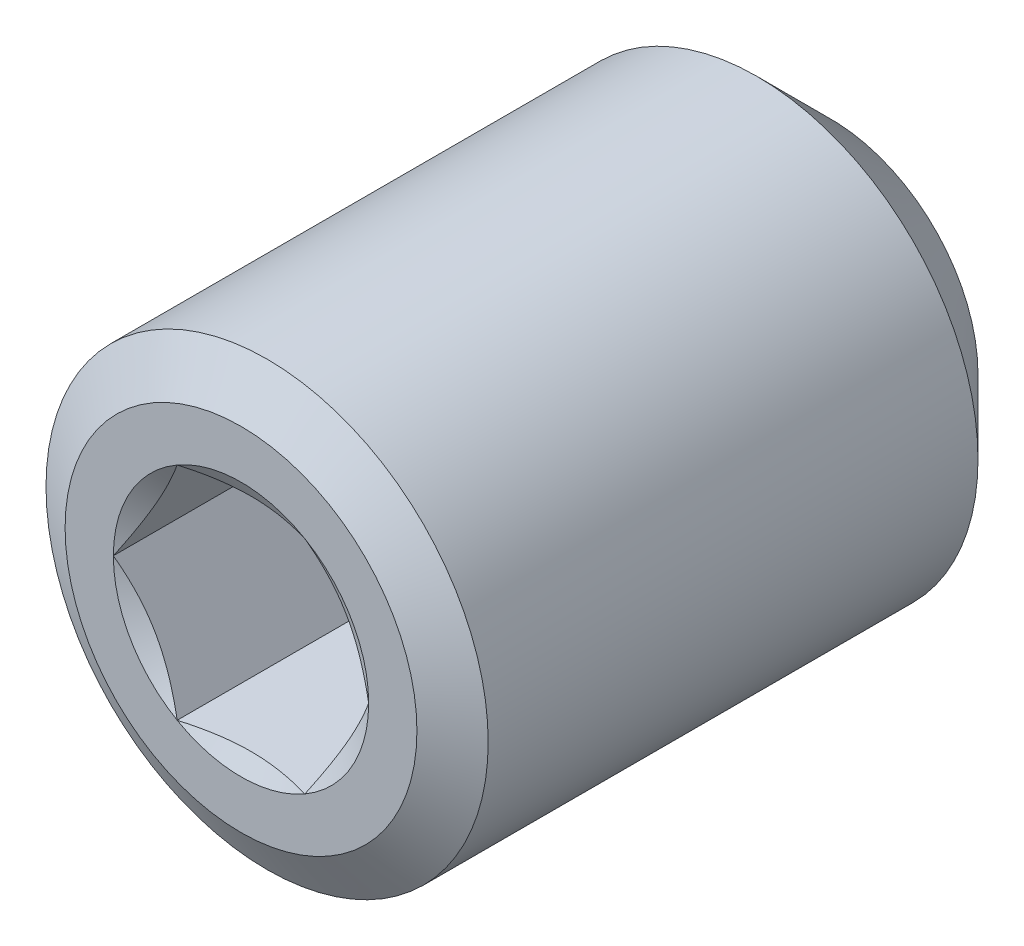
ISO-10303-21;
HEADER;
FILE_DESCRIPTION(('STEP AP214'),'2;1');
FILE_NAME('part.step','',(''),(''),'','','');
FILE_SCHEMA(('AUTOMOTIVE_DESIGN { 1 0 10303 214 1 1 1 1 }'));
ENDSEC;
DATA;
#1=APPLICATION_CONTEXT('core data for automotive mechanical design processes');
#2=APPLICATION_PROTOCOL_DEFINITION('international standard','automotive_design',2000,#1);
#3=PRODUCT_CONTEXT('',#1,'mechanical');
#4=PRODUCT('Part','Part','',(#3));
#5=PRODUCT_RELATED_PRODUCT_CATEGORY('part','',(#4));
#6=PRODUCT_DEFINITION_FORMATION('','',#4);
#7=PRODUCT_DEFINITION_CONTEXT('part definition',#1,'design');
#8=PRODUCT_DEFINITION('design','',#6,#7);
#9=PRODUCT_DEFINITION_SHAPE('','',#8);
#10=(LENGTH_UNIT() NAMED_UNIT(*) SI_UNIT(.MILLI.,.METRE.));
#11=(NAMED_UNIT(*) PLANE_ANGLE_UNIT() SI_UNIT($,.RADIAN.));
#12=(NAMED_UNIT(*) SI_UNIT($,.STERADIAN.) SOLID_ANGLE_UNIT());
#13=UNCERTAINTY_MEASURE_WITH_UNIT(LENGTH_MEASURE(1.E-05),#10,'distance_accuracy_value','');
#14=(GEOMETRIC_REPRESENTATION_CONTEXT(3) GLOBAL_UNCERTAINTY_ASSIGNED_CONTEXT((#13)) GLOBAL_UNIT_ASSIGNED_CONTEXT((#10,
#11,#12)) REPRESENTATION_CONTEXT('',''));
#15=CARTESIAN_POINT('',(0.,0.,0.));
#16=DIRECTION('',(0.,0.,1.));
#17=DIRECTION('',(1.,0.,0.));
#18=AXIS2_PLACEMENT_3D('',#15,#16,#17);
#19=CARTESIAN_POINT('',(-5.4,0.,6.05));
#20=DIRECTION('',(0.,0.,-1.));
#21=DIRECTION('',(-1.,0.,0.));
#22=AXIS2_PLACEMENT_3D('',#19,#20,#21);
#23=PLANE('',#22);
#24=DIRECTION('',(1.,0.,0.));
#25=VECTOR('',#24,1.);
#26=CARTESIAN_POINT('',(-5.83301270189222,-0.749999999999999,6.05));
#27=LINE('',#26,#25);
#28=CARTESIAN_POINT('',(-5.83301270189222,-0.749999999999999,6.05));
#29=VERTEX_POINT('',#28);
#30=CARTESIAN_POINT('',(-4.96698729810778,-0.749999999999999,6.05));
#31=VERTEX_POINT('',#30);
#32=EDGE_CURVE('E116',#29,#31,#27,.T.);
#33=ORIENTED_EDGE('',*,*,#32,.T.);
#34=DIRECTION('',(0.5,0.866025403784439,0.));
#35=VECTOR('',#34,1.);
#36=CARTESIAN_POINT('',(-4.96698729810778,-0.749999999999999,6.05));
#37=LINE('',#36,#35);
#38=CARTESIAN_POINT('',(-4.53397459621556,0.,6.05));
#39=VERTEX_POINT('',#38);
#40=EDGE_CURVE('E82',#31,#39,#37,.T.);
#41=ORIENTED_EDGE('',*,*,#40,.T.);
#42=DIRECTION('',(-0.5,0.866025403784439,0.));
#43=VECTOR('',#42,1.);
#44=CARTESIAN_POINT('',(-4.53397459621556,0.,6.05));
#45=LINE('',#44,#43);
#46=CARTESIAN_POINT('',(-4.96698729810778,0.750000000000001,6.05));
#47=VERTEX_POINT('',#46);
#48=EDGE_CURVE('E84',#39,#47,#45,.T.);
#49=ORIENTED_EDGE('',*,*,#48,.T.);
#50=DIRECTION('',(1.,0.,0.));
#51=VECTOR('',#50,1.);
#52=CARTESIAN_POINT('',(-4.96698729810778,0.750000000000001,6.05));
#53=LINE('',#52,#51);
#54=CARTESIAN_POINT('',(-5.83301270189222,0.750000000000001,6.05));
#55=VERTEX_POINT('',#54);
#56=EDGE_CURVE('E85',#47,#55,#53,.F.);
#57=ORIENTED_EDGE('',*,*,#56,.T.);
#58=DIRECTION('',(-0.5,-0.866025403784439,0.));
#59=VECTOR('',#58,1.);
#60=CARTESIAN_POINT('',(-5.83301270189222,0.750000000000001,6.05));
#61=LINE('',#60,#59);
#62=CARTESIAN_POINT('',(-6.26602540378444,0.,6.05));
#63=VERTEX_POINT('',#62);
#64=EDGE_CURVE('E71',#55,#63,#61,.T.);
#65=ORIENTED_EDGE('',*,*,#64,.T.);
#66=DIRECTION('',(0.5,-0.866025403784439,0.));
#67=VECTOR('',#66,1.);
#68=CARTESIAN_POINT('',(-6.26602540378444,0.,6.05));
#69=LINE('',#68,#67);
#70=EDGE_CURVE('E105',#63,#29,#69,.T.);
#71=ORIENTED_EDGE('',*,*,#70,.T.);
#72=EDGE_LOOP('',(#33,#41,#49,#57,#65,#71));
#73=FACE_BOUND('',#72,.T.);
#74=ADVANCED_FACE('F17',(#73),#23,.F.);
#75=CARTESIAN_POINT('',(-4.96698729810778,0.750000000000001,7.25));
#76=DIRECTION('',(0.,1.,0.));
#77=DIRECTION('',(0.,0.,1.));
#78=AXIS2_PLACEMENT_3D('',#75,#76,#77);
#79=PLANE('',#78);
#80=DIRECTION('',(0.,0.,1.));
#81=VECTOR('',#80,1.);
#82=CARTESIAN_POINT('',(-5.83301270189222,0.750000000000001,7.25));
#83=LINE('',#82,#81);
#84=CARTESIAN_POINT('',(-5.83301270188439,0.750000000021349,7.24999999999327));
#85=VERTEX_POINT('',#84);
#86=EDGE_CURVE('E91',#85,#55,#83,.F.);
#87=ORIENTED_EDGE('',*,*,#86,.T.);
#88=ORIENTED_EDGE('',*,*,#56,.F.);
#89=DIRECTION('',(0.,0.,1.));
#90=VECTOR('',#89,1.);
#91=CARTESIAN_POINT('',(-4.96698729810778,0.750000000000002,7.25));
#92=LINE('',#91,#90);
#93=CARTESIAN_POINT('',(-4.96698729810162,0.750000000010675,7.24999999999197));
#94=VERTEX_POINT('',#93);
#95=EDGE_CURVE('E58',#47,#94,#92,.T.);
#96=ORIENTED_EDGE('',*,*,#95,.T.);
#97=CARTESIAN_POINT('',(-4.9669872980988,0.750000000000001,7.24999999998745));
#98=CARTESIAN_POINT('',(-5.00253334717891,0.750000000000001,7.2397376648182));
#99=CARTESIAN_POINT('',(-5.03836059706336,0.750000000000001,7.23034220746279));
#100=CARTESIAN_POINT('',(-5.11059708569754,0.750000000000001,7.21373690236903));
#101=CARTESIAN_POINT('',(-5.14700743833595,0.750000000000001,7.20653194479867));
#102=CARTESIAN_POINT('',(-5.21941958688233,0.750000000000001,7.19494550076308));
#103=CARTESIAN_POINT('',(-5.2554111877375,0.750000000000001,7.19050224022856));
#104=CARTESIAN_POINT('',(-5.32760203793876,0.750000000000001,7.18453742650338));
#105=CARTESIAN_POINT('',(-5.36380101896938,0.750000000000001,7.18301270190296));
#106=CARTESIAN_POINT('',(-5.43619898103062,0.750000000000001,7.18301270190296));
#107=CARTESIAN_POINT('',(-5.47239796206124,0.750000000000001,7.18453742650338));
#108=CARTESIAN_POINT('',(-5.5445888122625,0.750000000000001,7.19050224022856));
#109=CARTESIAN_POINT('',(-5.58058041311767,0.750000000000001,7.19494550076308));
#110=CARTESIAN_POINT('',(-5.65299256166405,0.750000000000001,7.20653194479867));
#111=CARTESIAN_POINT('',(-5.68940291430246,0.750000000000001,7.21373690236903));
#112=CARTESIAN_POINT('',(-5.76163940293664,0.750000000000001,7.23034220746279));
#113=CARTESIAN_POINT('',(-5.79746665282109,0.750000000000001,7.2397376648182));
#114=CARTESIAN_POINT('',(-5.8330127019012,0.750000000000001,7.24999999998745));
#115=B_SPLINE_CURVE_WITH_KNOTS('',3,(#97,#98,#99,#100,#101,#102,#103,#104,#105,#106,#107,#108,
#109,#110,#111,#112,#113,#114),.UNSPECIFIED.,.F.,.F.,(4,2,2,2,2,2,2,2,4),(0.,0.111027523469266,
0.222301119783371,0.330986572190886,0.439553855000989,0.548121137811094,0.656806590218607,
0.768080186532712,0.879107710001979),.UNSPECIFIED.);
#116=EDGE_CURVE('E20',#94,#85,#115,.T.);
#117=ORIENTED_EDGE('',*,*,#116,.T.);
#118=EDGE_LOOP('',(#87,#88,#96,#117));
#119=FACE_BOUND('',#118,.T.);
#120=ADVANCED_FACE('F89',(#119),#79,.F.);
#121=CARTESIAN_POINT('',(-4.53397459621556,0.,7.25));
#122=DIRECTION('',(0.866025403784439,0.5,0.));
#123=DIRECTION('',(-0.5,0.866025403784439,0.));
#124=AXIS2_PLACEMENT_3D('',#121,#122,#123);
#125=PLANE('',#124);
#126=ORIENTED_EDGE('',*,*,#95,.F.);
#127=ORIENTED_EDGE('',*,*,#48,.F.);
#128=DIRECTION('',(0.,0.,1.));
#129=VECTOR('',#128,1.);
#130=CARTESIAN_POINT('',(-4.53397459621556,0.,7.25));
#131=LINE('',#130,#129);
#132=CARTESIAN_POINT('',(-4.53397459620324,0.,7.24999999999197));
#133=VERTEX_POINT('',#132);
#134=EDGE_CURVE('E97',#39,#133,#131,.T.);
#135=ORIENTED_EDGE('',*,*,#134,.T.);
#136=CARTESIAN_POINT('',(-4.53397459621107,-7.77831101686523E-12,7.24999999998745));
#137=CARTESIAN_POINT('',(-4.55300288191491,0.0329579576122051,7.23901082827139));
#138=CARTESIAN_POINT('',(-4.57219541962215,0.0662004080473306,7.22901675266053));
#139=CARTESIAN_POINT('',(-4.6109128010648,0.133260879842025,7.21157239449462));
#140=CARTESIAN_POINT('',(-4.6304383325094,0.167080092348856,7.20412828242054));
#141=CARTESIAN_POINT('',(-4.66924742519736,0.234299412680047,7.19254098480828));
#142=CARTESIAN_POINT('',(-4.68852501683877,0.267689180850541,7.18832067040491));
#143=CARTESIAN_POINT('',(-4.72717086025429,0.334625745147565,7.18328343799773));
#144=CARTESIAN_POINT('',(-4.74653897165761,0.368172298144786,7.18246234772907));
#145=CARTESIAN_POINT('',(-4.78272621005057,0.430850433626997,7.18417485882044));
#146=CARTESIAN_POINT('',(-4.79955076723076,0.45999142147793,7.18628798195908));
#147=CARTESIAN_POINT('',(-4.83309027509029,0.518083553151492,7.19298398776408));
#148=CARTESIAN_POINT('',(-4.84980510985202,0.547034496198919,7.19756915553422));
#149=CARTESIAN_POINT('',(-4.88341371226155,0.605246303143616,7.20903118749734));
#150=CARTESIAN_POINT('',(-4.90030322843297,0.63449980326777,7.21595661582554));
#151=CARTESIAN_POINT('',(-4.93383042649982,0.692570613754971,7.23167441030472));
#152=CARTESIAN_POINT('',(-4.95046853758607,0.721388667498332,7.24046308577011));
#153=CARTESIAN_POINT('',(-4.96698729811227,0.750000000007781,7.24999999998745));
#154=B_SPLINE_CURVE_WITH_KNOTS('',3,(#136,#137,#138,#139,#140,#141,#142,#143,#144,#145,#146,
#147,#148,#149,#150,#151,#152,#153),.UNSPECIFIED.,.F.,.F.,(4,2,2,2,2,2,2,2,4),(0.,
0.118881004361371,0.238047681444985,0.354265352364141,0.470340333390544,0.571390418547985,
0.672534072741057,0.775920608507762,0.879104240149057),.UNSPECIFIED.);
#155=EDGE_CURVE('E95',#133,#94,#154,.T.);
#156=ORIENTED_EDGE('',*,*,#155,.T.);
#157=EDGE_LOOP('',(#126,#127,#135,#156));
#158=FACE_BOUND('',#157,.T.);
#159=ADVANCED_FACE('F93',(#158),#125,.F.);
#160=CARTESIAN_POINT('',(-4.96698729810778,-0.749999999999999,7.25));
#161=DIRECTION('',(0.866025403784439,-0.5,0.));
#162=DIRECTION('',(0.5,0.866025403784439,0.));
#163=AXIS2_PLACEMENT_3D('',#160,#161,#162);
#164=PLANE('',#163);
#165=ORIENTED_EDGE('',*,*,#134,.F.);
#166=ORIENTED_EDGE('',*,*,#40,.F.);
#167=DIRECTION('',(0.,0.,-1.));
#168=VECTOR('',#167,1.);
#169=CARTESIAN_POINT('',(-4.96698729810778,-0.749999999999999,7.25));
#170=LINE('',#169,#168);
#171=CARTESIAN_POINT('',(-4.96698729810162,-0.750000000010673,7.25000000000399));
#172=VERTEX_POINT('',#171);
#173=EDGE_CURVE('E108',#31,#172,#170,.F.);
#174=ORIENTED_EDGE('',*,*,#173,.T.);
#175=CARTESIAN_POINT('',(-4.96698729811396,-0.750000000007281,7.24999999998869));
#176=CARTESIAN_POINT('',(-4.94795901240921,-0.717042042387902,7.23901082827192));
#177=CARTESIAN_POINT('',(-4.92876647470155,-0.683799591952968,7.22901675266074));
#178=CARTESIAN_POINT('',(-4.89004909325854,-0.6167391201583,7.21157239449456));
#179=CARTESIAN_POINT('',(-4.87052356181398,-0.582919907651302,7.20412828242054));
#180=CARTESIAN_POINT('',(-4.831714469126,-0.515700587319894,7.1925409848083));
#181=CARTESIAN_POINT('',(-4.81243687748452,-0.482310819149347,7.18832067040491));
#182=CARTESIAN_POINT('',(-4.7737910340689,-0.415374254852186,7.18328343799771));
#183=CARTESIAN_POINT('',(-4.75442292266553,-0.381827701854883,7.18246234772906));
#184=CARTESIAN_POINT('',(-4.71823568427255,-0.319149566372629,7.18417485882047));
#185=CARTESIAN_POINT('',(-4.70141112709239,-0.290008578521735,7.18628798195912));
#186=CARTESIAN_POINT('',(-4.6678716192329,-0.231916446848252,7.19298398776411));
#187=CARTESIAN_POINT('',(-4.6511567844712,-0.202965503800864,7.19756915553425));
#188=CARTESIAN_POINT('',(-4.6175481820617,-0.144753696856239,7.20903118749737));
#189=CARTESIAN_POINT('',(-4.6006586658903,-0.115500196732117,7.21595661582557));
#190=CARTESIAN_POINT('',(-4.56713146782349,-0.0574293862449746,7.23167441030474));
#191=CARTESIAN_POINT('',(-4.55049335673726,-0.0286113325016418,7.24046308577012));
#192=CARTESIAN_POINT('',(-4.53397459621107,7.7807565036674E-12,7.24999999998745));
#193=B_SPLINE_CURVE_WITH_KNOTS('',3,(#175,#176,#177,#178,#179,#180,#181,#182,#183,#184,#185,
#186,#187,#188,#189,#190,#191,#192),.UNSPECIFIED.,.F.,.F.,(4,2,2,2,2,2,2,2,4),(0.,
0.118881004361718,0.238047681445647,0.354265352365057,0.470340333391727,0.571390418549038,
0.672534072741974,0.77592060850857,0.879104240149767),.UNSPECIFIED.);
#194=EDGE_CURVE('E190',#172,#133,#193,.T.);
#195=ORIENTED_EDGE('',*,*,#194,.T.);
#196=EDGE_LOOP('',(#165,#166,#174,#195));
#197=FACE_BOUND('',#196,.T.);
#198=ADVANCED_FACE('F199',(#197),#164,.F.);
#199=CARTESIAN_POINT('',(-5.83301270189222,-0.749999999999999,7.25));
#200=DIRECTION('',(0.,-1.,0.));
#201=DIRECTION('',(0.,0.,-1.));
#202=AXIS2_PLACEMENT_3D('',#199,#200,#201);
#203=PLANE('',#202);
#204=ORIENTED_EDGE('',*,*,#173,.F.);
#205=ORIENTED_EDGE('',*,*,#32,.F.);
#206=DIRECTION('',(0.,0.,1.));
#207=VECTOR('',#206,1.);
#208=CARTESIAN_POINT('',(-5.83301270189222,-0.75,7.25));
#209=LINE('',#208,#207);
#210=CARTESIAN_POINT('',(-5.83301270189222,-0.75,7.2500000000204));
#211=VERTEX_POINT('',#210);
#212=EDGE_CURVE('E107',#29,#211,#209,.T.);
#213=ORIENTED_EDGE('',*,*,#212,.T.);
#214=CARTESIAN_POINT('',(-5.8330127018994,-0.749999999999999,7.25000000001096));
#215=CARTESIAN_POINT('',(-5.79746665281979,-0.749999999999999,7.23973766483822));
#216=CARTESIAN_POINT('',(-5.76163940293568,-0.749999999999999,7.23034220747957));
#217=CARTESIAN_POINT('',(-5.68940291430177,-0.749999999999999,7.21373690237998));
#218=CARTESIAN_POINT('',(-5.65299256166328,-0.749999999999999,7.20653194480705));
#219=CARTESIAN_POINT('',(-5.58058041311704,-0.749999999999999,7.1949455007674));
#220=CARTESIAN_POINT('',(-5.54458881226208,-0.749999999999999,7.19050224023133));
#221=CARTESIAN_POINT('',(-5.4723979620611,-0.749999999999999,7.18453742650406));
#222=CARTESIAN_POINT('',(-5.43619898103055,-0.749999999999999,7.18301270190311));
#223=CARTESIAN_POINT('',(-5.36380101896978,-0.749999999999999,7.18301270190311));
#224=CARTESIAN_POINT('',(-5.32760203793956,-0.749999999999999,7.18453742650403));
#225=CARTESIAN_POINT('',(-5.25541118773924,-0.749999999999999,7.19050224023119));
#226=CARTESIAN_POINT('',(-5.2194195868846,-0.749999999999999,7.19494550076719));
#227=CARTESIAN_POINT('',(-5.147007438339,-0.749999999999999,7.20653194480663));
#228=CARTESIAN_POINT('',(-5.11059708570085,-0.749999999999999,7.21373690237944));
#229=CARTESIAN_POINT('',(-5.03836059706758,-0.749999999999999,7.23034220747875));
#230=CARTESIAN_POINT('',(-5.00253334718378,-0.749999999999999,7.23973766483726));
#231=CARTESIAN_POINT('',(-4.96698729810449,-0.749999999999999,7.25000000000983));
#232=B_SPLINE_CURVE_WITH_KNOTS('',3,(#214,#215,#216,#217,#218,#219,#220,#221,#222,#223,#224,
#225,#226,#227,#228,#229,#230,#231),.UNSPECIFIED.,.F.,.F.,(4,2,2,2,2,2,2,2,4),(0.,
0.111027523470713,0.222301119786472,0.330986572193851,0.439553855003719,0.548121137812601,
0.65680659021899,0.76808018653371,0.879107710003394),.UNSPECIFIED.);
#233=EDGE_CURVE('E184',#211,#172,#232,.T.);
#234=ORIENTED_EDGE('',*,*,#233,.T.);
#235=EDGE_LOOP('',(#204,#205,#213,#234));
#236=FACE_BOUND('',#235,.T.);
#237=ADVANCED_FACE('F195',(#236),#203,.F.);
#238=CARTESIAN_POINT('',(-6.26602540378444,0.,7.25));
#239=DIRECTION('',(-0.866025403784439,-0.5,0.));
#240=DIRECTION('',(0.5,-0.866025403784439,0.));
#241=AXIS2_PLACEMENT_3D('',#238,#239,#240);
#242=PLANE('',#241);
#243=ORIENTED_EDGE('',*,*,#212,.F.);
#244=ORIENTED_EDGE('',*,*,#70,.F.);
#245=DIRECTION('',(0.,0.,1.));
#246=VECTOR('',#245,1.);
#247=CARTESIAN_POINT('',(-6.26602540378444,0.,7.25));
#248=LINE('',#247,#246);
#249=CARTESIAN_POINT('',(-6.26602540379676,0.,7.24999999999197));
#250=VERTEX_POINT('',#249);
#251=EDGE_CURVE('E39',#63,#250,#248,.T.);
#252=ORIENTED_EDGE('',*,*,#251,.T.);
#253=CARTESIAN_POINT('',(-6.26602540378893,7.78089463416162E-12,7.24999999998745));
#254=CARTESIAN_POINT('',(-6.24699711808509,-0.0329579576122041,7.23901082827139));
#255=CARTESIAN_POINT('',(-6.22780458037785,-0.0662004080473309,7.22901675266053));
#256=CARTESIAN_POINT('',(-6.1890871989352,-0.133260879842028,7.21157239449461));
#257=CARTESIAN_POINT('',(-6.1695616674906,-0.167080092348861,7.20412828242054));
#258=CARTESIAN_POINT('',(-6.13075257480264,-0.234299412680052,7.19254098480828));
#259=CARTESIAN_POINT('',(-6.11147498316123,-0.267689180850544,7.18832067040491));
#260=CARTESIAN_POINT('',(-6.07282913974571,-0.334625745147566,7.18328343799773));
#261=CARTESIAN_POINT('',(-6.05346102834238,-0.368172298144784,7.18246234772907));
#262=CARTESIAN_POINT('',(-6.01727378994923,-0.430850433627343,7.18417485882045));
#263=CARTESIAN_POINT('',(-6.00044923276884,-0.459991421478624,7.18628798195913));
#264=CARTESIAN_POINT('',(-5.96690972490891,-0.518083553152876,7.19298398776427));
#265=CARTESIAN_POINT('',(-5.95019489014699,-0.547034496200644,7.1975691555345));
#266=CARTESIAN_POINT('',(-5.91658628773705,-0.605246303146033,7.20903118749787));
#267=CARTESIAN_POINT('',(-5.89969677156543,-0.634499803270536,7.21595661582622));
#268=CARTESIAN_POINT('',(-5.86616957349819,-0.692570613758423,7.23167441030572));
#269=CARTESIAN_POINT('',(-5.84953146241175,-0.721388667502121,7.2404630857713));
#270=CARTESIAN_POINT('',(-5.83301270188535,-0.750000000011902,7.24999999998883));
#271=B_SPLINE_CURVE_WITH_KNOTS('',3,(#253,#254,#255,#256,#257,#258,#259,#260,#261,#262,#263,
#264,#265,#266,#267,#268,#269,#270),.UNSPECIFIED.,.F.,.F.,(4,2,2,2,2,2,2,2,4),(0.,
0.118881004361376,0.238047681444995,0.354265352364147,0.470340333390545,0.571390418549192,
0.672534072743475,0.775920608511453,0.879104240154011),.UNSPECIFIED.);
#272=EDGE_CURVE('E155',#250,#211,#271,.T.);
#273=ORIENTED_EDGE('',*,*,#272,.T.);
#274=EDGE_LOOP('',(#243,#244,#252,#273));
#275=FACE_BOUND('',#274,.T.);
#276=ADVANCED_FACE('F198',(#275),#242,.F.);
#277=CARTESIAN_POINT('',(-5.83301270189222,0.750000000000001,7.25));
#278=DIRECTION('',(-0.866025403784439,0.5,0.));
#279=DIRECTION('',(-0.5,-0.866025403784439,0.));
#280=AXIS2_PLACEMENT_3D('',#277,#278,#279);
#281=PLANE('',#280);
#282=ORIENTED_EDGE('',*,*,#251,.F.);
#283=ORIENTED_EDGE('',*,*,#64,.F.);
#284=ORIENTED_EDGE('',*,*,#86,.F.);
#285=CARTESIAN_POINT('',(-5.83301270188773,0.75000000000778,7.24999999998745));
#286=CARTESIAN_POINT('',(-5.85204098759157,0.717042042387797,7.23901082827139));
#287=CARTESIAN_POINT('',(-5.87123352529881,0.683799591952671,7.22901675266053));
#288=CARTESIAN_POINT('',(-5.90995090674146,0.616739120157977,7.21157239449461));
#289=CARTESIAN_POINT('',(-5.92947643818606,0.582919907651145,7.20412828242054));
#290=CARTESIAN_POINT('',(-5.96828553087402,0.515700587319955,7.19254098480828));
#291=CARTESIAN_POINT('',(-5.98756312251543,0.482310819149462,7.18832067040491));
#292=CARTESIAN_POINT('',(-6.02620896593095,0.415374254852437,7.18328343799773));
#293=CARTESIAN_POINT('',(-6.04557707733427,0.381827701855217,7.18246234772907));
#294=CARTESIAN_POINT('',(-6.08176431572723,0.319149566373006,7.18417485882044));
#295=CARTESIAN_POINT('',(-6.09858887290742,0.290008578522072,7.18628798195908));
#296=CARTESIAN_POINT('',(-6.13212838076695,0.23191644684851,7.19298398776408));
#297=CARTESIAN_POINT('',(-6.14884321552868,0.202965503801083,7.19756915553422));
#298=CARTESIAN_POINT('',(-6.18245181793821,0.144753696856386,7.20903118749734));
#299=CARTESIAN_POINT('',(-6.19934133410963,0.115500196732233,7.21595661582554));
#300=CARTESIAN_POINT('',(-6.23286853217648,0.0574293862450315,7.23167441030472));
#301=CARTESIAN_POINT('',(-6.24950664326273,0.0286113325016707,7.24046308577011));
#302=CARTESIAN_POINT('',(-6.26602540378893,-7.77911706122302E-12,7.24999999998745));
#303=B_SPLINE_CURVE_WITH_KNOTS('',3,(#285,#286,#287,#288,#289,#290,#291,#292,#293,#294,#295,
#296,#297,#298,#299,#300,#301,#302),.UNSPECIFIED.,.F.,.F.,(4,2,2,2,2,2,2,2,4),(0.,
0.118881004361371,0.238047681444985,0.35426535236414,0.470340333390543,0.571390418547985,
0.672534072741056,0.775920608507761,0.879104240149057),.UNSPECIFIED.);
#304=EDGE_CURVE('E148',#85,#250,#303,.T.);
#305=ORIENTED_EDGE('',*,*,#304,.T.);
#306=EDGE_LOOP('',(#282,#283,#284,#305));
#307=FACE_BOUND('',#306,.T.);
#308=ADVANCED_FACE('F162',(#307),#281,.F.);
#309=CARTESIAN_POINT('',(-5.4,0.,7.24999999999909));
#310=DIRECTION('',(0.,0.,1.));
#311=DIRECTION('',(1.,0.,0.));
#312=AXIS2_PLACEMENT_3D('',#309,#310,#311);
#313=CONICAL_SURFACE('',#312,0.866025403809089,1.04719755136393);
#314=ORIENTED_EDGE('',*,*,#116,.F.);
#315=CARTESIAN_POINT('',(-5.4,0.,7.24999999999909));
#316=DIRECTION('',(0.,0.,1.));
#317=DIRECTION('',(1.,0.,0.));
#318=AXIS2_PLACEMENT_3D('',#315,#316,#317);
#319=CIRCLE('',#318,0.86602540380909);
#320=EDGE_CURVE('E145',#85,#94,#319,.F.);
#321=ORIENTED_EDGE('',*,*,#320,.F.);
#322=EDGE_LOOP('',(#314,#321));
#323=FACE_BOUND('',#322,.T.);
#324=ADVANCED_FACE('F215',(#323),#313,.F.);
#325=CARTESIAN_POINT('',(-5.4,0.,7.24999999999909));
#326=DIRECTION('',(0.,0.,1.));
#327=DIRECTION('',(1.,0.,0.));
#328=AXIS2_PLACEMENT_3D('',#325,#326,#327);
#329=CONICAL_SURFACE('',#328,0.866025403809089,1.04719755130704);
#330=CARTESIAN_POINT('',(-5.4,0.,7.24999999999909));
#331=DIRECTION('',(0.,0.,1.));
#332=DIRECTION('',(1.,0.,0.));
#333=AXIS2_PLACEMENT_3D('',#330,#331,#332);
#334=CIRCLE('',#333,0.866025403809089);
#335=EDGE_CURVE('E142',#94,#133,#334,.F.);
#336=ORIENTED_EDGE('',*,*,#335,.F.);
#337=ORIENTED_EDGE('',*,*,#155,.F.);
#338=EDGE_LOOP('',(#336,#337));
#339=FACE_BOUND('',#338,.T.);
#340=ADVANCED_FACE('F212',(#339),#329,.F.);
#341=CARTESIAN_POINT('',(-5.4,0.,7.24999999999909));
#342=DIRECTION('',(0.,0.,1.));
#343=DIRECTION('',(1.,0.,0.));
#344=AXIS2_PLACEMENT_3D('',#341,#342,#343);
#345=CONICAL_SURFACE('',#344,0.866025403809089,1.04719755130704);
#346=CARTESIAN_POINT('',(-5.4,0.,7.24999999999909));
#347=DIRECTION('',(0.,0.,1.));
#348=DIRECTION('',(1.,0.,0.));
#349=AXIS2_PLACEMENT_3D('',#346,#347,#348);
#350=CIRCLE('',#349,0.866025403809089);
#351=EDGE_CURVE('E139',#133,#172,#350,.F.);
#352=ORIENTED_EDGE('',*,*,#351,.F.);
#353=ORIENTED_EDGE('',*,*,#194,.F.);
#354=EDGE_LOOP('',(#352,#353));
#355=FACE_BOUND('',#354,.T.);
#356=ADVANCED_FACE('F180',(#355),#345,.F.);
#357=CARTESIAN_POINT('',(-5.4,0.,7.25000000005593));
#358=DIRECTION('',(0.,0.,1.));
#359=DIRECTION('',(1.,0.,0.));
#360=AXIS2_PLACEMENT_3D('',#357,#358,#359);
#361=CONICAL_SURFACE('',#360,0.866025403865932,1.04719755120955);
#362=ORIENTED_EDGE('',*,*,#233,.F.);
#363=CARTESIAN_POINT('',(-5.4,0.,7.25000000005593));
#364=DIRECTION('',(0.,0.,1.));
#365=DIRECTION('',(1.,0.,0.));
#366=AXIS2_PLACEMENT_3D('',#363,#364,#365);
#367=CIRCLE('',#366,0.866025403865933);
#368=EDGE_CURVE('E136',#172,#211,#367,.F.);
#369=ORIENTED_EDGE('',*,*,#368,.F.);
#370=EDGE_LOOP('',(#362,#369));
#371=FACE_BOUND('',#370,.T.);
#372=ADVANCED_FACE('F175',(#371),#361,.F.);
#373=CARTESIAN_POINT('',(-5.4,0.,7.24999999999909));
#374=DIRECTION('',(0.,0.,1.));
#375=DIRECTION('',(1.,0.,0.));
#376=AXIS2_PLACEMENT_3D('',#373,#374,#375);
#377=CONICAL_SURFACE('',#376,0.866025403809089,1.04719755130704);
#378=CARTESIAN_POINT('',(-5.4,0.,7.24999999999909));
#379=DIRECTION('',(0.,0.,1.));
#380=DIRECTION('',(1.,0.,0.));
#381=AXIS2_PLACEMENT_3D('',#378,#379,#380);
#382=CIRCLE('',#381,0.866025403809089);
#383=EDGE_CURVE('E133',#211,#250,#382,.F.);
#384=ORIENTED_EDGE('',*,*,#383,.F.);
#385=ORIENTED_EDGE('',*,*,#272,.F.);
#386=EDGE_LOOP('',(#384,#385));
#387=FACE_BOUND('',#386,.T.);
#388=ADVANCED_FACE('F169',(#387),#377,.F.);
#389=CARTESIAN_POINT('',(-5.4,0.,7.24999999999909));
#390=DIRECTION('',(0.,0.,1.));
#391=DIRECTION('',(1.,0.,0.));
#392=AXIS2_PLACEMENT_3D('',#389,#390,#391);
#393=CONICAL_SURFACE('',#392,0.866025403809089,1.04719755130704);
#394=CARTESIAN_POINT('',(-5.4,0.,7.24999999999909));
#395=DIRECTION('',(0.,0.,1.));
#396=DIRECTION('',(1.,0.,0.));
#397=AXIS2_PLACEMENT_3D('',#394,#395,#396);
#398=CIRCLE('',#397,0.866025403809089);
#399=EDGE_CURVE('E130',#250,#85,#398,.F.);
#400=ORIENTED_EDGE('',*,*,#399,.F.);
#401=ORIENTED_EDGE('',*,*,#304,.F.);
#402=EDGE_LOOP('',(#400,#401));
#403=FACE_BOUND('',#402,.T.);
#404=ADVANCED_FACE('F164',(#403),#393,.F.);
#405=CARTESIAN_POINT('',(-5.4,1.02976270189222,7.25));
#406=DIRECTION('',(0.,0.,1.));
#407=DIRECTION('',(0.,-1.,0.));
#408=AXIS2_PLACEMENT_3D('',#405,#406,#407);
#409=PLANE('',#408);
#410=ORIENTED_EDGE('',*,*,#383,.T.);
#411=ORIENTED_EDGE('',*,*,#399,.T.);
#412=ORIENTED_EDGE('',*,*,#320,.T.);
#413=ORIENTED_EDGE('',*,*,#335,.T.);
#414=ORIENTED_EDGE('',*,*,#351,.T.);
#415=ORIENTED_EDGE('',*,*,#368,.T.);
#416=EDGE_LOOP('',(#410,#411,#412,#413,#414,#415));
#417=FACE_BOUND('',#416,.T.);
#418=CARTESIAN_POINT('',(-5.4,0.,7.25000000000553));
#419=DIRECTION('',(0.,0.,-1.));
#420=DIRECTION('',(-1.,0.,0.));
#421=AXIS2_PLACEMENT_3D('',#418,#419,#420);
#422=CIRCLE('',#421,1.1934999999994);
#423=CARTESIAN_POINT('',(-6.5934999999994,0.,7.25000000000553));
#424=VERTEX_POINT('',#423);
#425=EDGE_CURVE('E127',#424,#424,#422,.T.);
#426=ORIENTED_EDGE('',*,*,#425,.F.);
#427=EDGE_LOOP('',(#426));
#428=FACE_BOUND('',#427,.T.);
#429=ADVANCED_FACE('F168',(#417,#428),#409,.T.);
#430=CARTESIAN_POINT('',(-5.4,0.500000000000001,3.25));
#431=DIRECTION('',(0.,0.,-1.));
#432=DIRECTION('',(-1.,0.,0.));
#433=AXIS2_PLACEMENT_3D('',#430,#431,#432);
#434=PLANE('',#433);
#435=CARTESIAN_POINT('',(-5.4,0.,3.25000000003683));
#436=DIRECTION('',(0.,0.,1.));
#437=DIRECTION('',(1.,0.,0.));
#438=AXIS2_PLACEMENT_3D('',#435,#436,#437);
#439=CIRCLE('',#438,1.00000000014688);
#440=CARTESIAN_POINT('',(-4.39999999985312,0.,3.25000000003683));
#441=VERTEX_POINT('',#440);
#442=EDGE_CURVE('E124',#441,#441,#439,.T.);
#443=ORIENTED_EDGE('',*,*,#442,.F.);
#444=EDGE_LOOP('',(#443));
#445=FACE_BOUND('',#444,.T.);
#446=ADVANCED_FACE('F240',(#445),#434,.T.);
#447=CARTESIAN_POINT('',(-5.4,0.,7.07304214262194));
#448=DIRECTION('',(0.,0.,-1.));
#449=DIRECTION('',(-1.,0.,0.));
#450=AXIS2_PLACEMENT_3D('',#447,#448,#449);
#451=CONICAL_SURFACE('',#450,1.49999999973716,1.04719755112717);
#452=ORIENTED_EDGE('',*,*,#425,.T.);
#453=EDGE_LOOP('',(#452));
#454=FACE_BOUND('',#453,.T.);
#455=CARTESIAN_POINT('',(-5.4,0.,7.07304214249338));
#456=DIRECTION('',(0.,0.,1.));
#457=DIRECTION('',(0.,-1.,0.));
#458=AXIS2_PLACEMENT_3D('',#455,#456,#457);
#459=CIRCLE('',#458,1.5);
#460=CARTESIAN_POINT('',(-5.4,-1.5,7.07304214249338));
#461=VERTEX_POINT('',#460);
#462=EDGE_CURVE('E30',#461,#461,#459,.F.);
#463=ORIENTED_EDGE('',*,*,#462,.F.);
#464=EDGE_LOOP('',(#463));
#465=FACE_BOUND('',#464,.T.);
#466=ADVANCED_FACE('F233',(#454,#465),#451,.T.);
#467=CARTESIAN_POINT('',(-5.4,0.,3.75000000008185));
#468=DIRECTION('',(0.,0.,1.));
#469=DIRECTION('',(1.,0.,0.));
#470=AXIS2_PLACEMENT_3D('',#467,#468,#469);
#471=CONICAL_SURFACE('',#470,1.50000000013506,0.785398163340605);
#472=ORIENTED_EDGE('',*,*,#442,.T.);
#473=EDGE_LOOP('',(#472));
#474=FACE_BOUND('',#473,.T.);
#475=CARTESIAN_POINT('',(-5.4,0.,3.75));
#476=DIRECTION('',(0.,0.,1.));
#477=DIRECTION('',(0.,-1.,0.));
#478=AXIS2_PLACEMENT_3D('',#475,#476,#477);
#479=CIRCLE('',#478,1.5);
#480=CARTESIAN_POINT('',(-5.4,-1.5,3.75));
#481=VERTEX_POINT('',#480);
#482=EDGE_CURVE('E11',#481,#481,#479,.T.);
#483=ORIENTED_EDGE('',*,*,#482,.F.);
#484=EDGE_LOOP('',(#483));
#485=FACE_BOUND('',#484,.T.);
#486=ADVANCED_FACE('F227',(#474,#485),#471,.T.);
#487=CARTESIAN_POINT('',(-5.4,0.,5.41152107124669));
#488=DIRECTION('',(0.,0.,1.));
#489=DIRECTION('',(0.,-1.,0.));
#490=AXIS2_PLACEMENT_3D('',#487,#488,#489);
#491=CYLINDRICAL_SURFACE('',#490,1.5);
#492=ORIENTED_EDGE('',*,*,#462,.T.);
#493=EDGE_LOOP('',(#492));
#494=FACE_BOUND('',#493,.T.);
#495=ORIENTED_EDGE('',*,*,#482,.T.);
#496=EDGE_LOOP('',(#495));
#497=FACE_BOUND('',#496,.T.);
#498=ADVANCED_FACE('F225',(#494,#497),#491,.T.);
#499=CLOSED_SHELL('',(#74,#120,#159,#198,#237,#276,#308,#324,#340,#356,#372,#388,#404,#429,#446,
#466,#486,#498));
#500=MANIFOLD_SOLID_BREP('B1',#499);
#501=ADVANCED_BREP_SHAPE_REPRESENTATION('',(#18,#500),#14);
#502=SHAPE_DEFINITION_REPRESENTATION(#9,#501);
ENDSEC;
END-ISO-10303-21;
